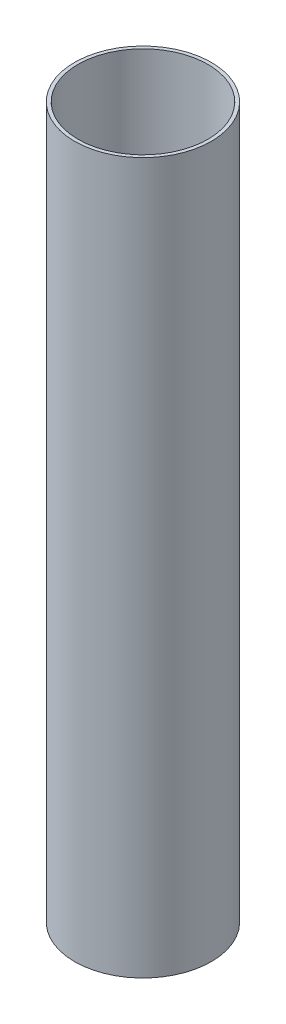
ISO-10303-21;
HEADER;
FILE_DESCRIPTION(('STEP AP214'),'2;1');
FILE_NAME('part.step','',(''),(''),'','','');
FILE_SCHEMA(('AUTOMOTIVE_DESIGN { 1 0 10303 214 1 1 1 1 }'));
ENDSEC;
DATA;
#1=APPLICATION_CONTEXT('core data for automotive mechanical design processes');
#2=APPLICATION_PROTOCOL_DEFINITION('international standard','automotive_design',2000,#1);
#3=PRODUCT_CONTEXT('',#1,'mechanical');
#4=PRODUCT('Part','Part','',(#3));
#5=PRODUCT_RELATED_PRODUCT_CATEGORY('part','',(#4));
#6=PRODUCT_DEFINITION_FORMATION('','',#4);
#7=PRODUCT_DEFINITION_CONTEXT('part definition',#1,'design');
#8=PRODUCT_DEFINITION('design','',#6,#7);
#9=PRODUCT_DEFINITION_SHAPE('','',#8);
#10=(LENGTH_UNIT() NAMED_UNIT(*) SI_UNIT(.MILLI.,.METRE.));
#11=(NAMED_UNIT(*) PLANE_ANGLE_UNIT() SI_UNIT($,.RADIAN.));
#12=(NAMED_UNIT(*) SI_UNIT($,.STERADIAN.) SOLID_ANGLE_UNIT());
#13=UNCERTAINTY_MEASURE_WITH_UNIT(LENGTH_MEASURE(1.E-05),#10,'distance_accuracy_value','');
#14=(GEOMETRIC_REPRESENTATION_CONTEXT(3) GLOBAL_UNCERTAINTY_ASSIGNED_CONTEXT((#13)) GLOBAL_UNIT_ASSIGNED_CONTEXT((#10,
#11,#12)) REPRESENTATION_CONTEXT('',''));
#15=CARTESIAN_POINT('',(0.,0.,0.));
#16=DIRECTION('',(0.,0.,1.));
#17=DIRECTION('',(1.,0.,0.));
#18=AXIS2_PLACEMENT_3D('',#15,#16,#17);
#19=CARTESIAN_POINT('',(0.,362.585,0.));
#20=DIRECTION('',(0.,1.,0.));
#21=DIRECTION('',(0.,0.,1.));
#22=AXIS2_PLACEMENT_3D('',#19,#20,#21);
#23=PLANE('',#22);
#24=CARTESIAN_POINT('',(0.,362.585,0.));
#25=DIRECTION('',(0.,1.,0.));
#26=DIRECTION('',(0.,0.,1.));
#27=AXIS2_PLACEMENT_3D('',#24,#25,#26);
#28=CIRCLE('',#27,34.8996);
#29=CARTESIAN_POINT('',(0.,362.585,34.8996));
#30=VERTEX_POINT('',#29);
#31=EDGE_CURVE('E10',#30,#30,#28,.T.);
#32=ORIENTED_EDGE('',*,*,#31,.T.);
#33=EDGE_LOOP('',(#32));
#34=FACE_BOUND('',#33,.T.);
#35=CARTESIAN_POINT('',(0.,362.585,0.));
#36=DIRECTION('',(0.,1.,0.));
#37=DIRECTION('',(0.,0.,1.));
#38=AXIS2_PLACEMENT_3D('',#35,#36,#37);
#39=CIRCLE('',#38,33.147);
#40=CARTESIAN_POINT('',(0.,362.585,33.147));
#41=VERTEX_POINT('',#40);
#42=EDGE_CURVE('E47',#41,#41,#39,.T.);
#43=ORIENTED_EDGE('',*,*,#42,.F.);
#44=EDGE_LOOP('',(#43));
#45=FACE_BOUND('',#44,.T.);
#46=ADVANCED_FACE('F36',(#34,#45),#23,.T.);
#47=CARTESIAN_POINT('',(0.,0.,0.));
#48=DIRECTION('',(0.,1.,0.));
#49=DIRECTION('',(0.,0.,1.));
#50=AXIS2_PLACEMENT_3D('',#47,#48,#49);
#51=PLANE('',#50);
#52=CARTESIAN_POINT('',(0.,0.,0.));
#53=DIRECTION('',(0.,1.,0.));
#54=DIRECTION('',(0.,0.,1.));
#55=AXIS2_PLACEMENT_3D('',#52,#53,#54);
#56=CIRCLE('',#55,34.8996);
#57=CARTESIAN_POINT('',(0.,0.,34.8996));
#58=VERTEX_POINT('',#57);
#59=EDGE_CURVE('E40',#58,#58,#56,.T.);
#60=ORIENTED_EDGE('',*,*,#59,.F.);
#61=EDGE_LOOP('',(#60));
#62=FACE_BOUND('',#61,.T.);
#63=CARTESIAN_POINT('',(0.,0.,0.));
#64=DIRECTION('',(0.,1.,0.));
#65=DIRECTION('',(0.,0.,1.));
#66=AXIS2_PLACEMENT_3D('',#63,#64,#65);
#67=CIRCLE('',#66,33.147);
#68=CARTESIAN_POINT('',(0.,0.,33.147));
#69=VERTEX_POINT('',#68);
#70=EDGE_CURVE('E49',#69,#69,#67,.T.);
#71=ORIENTED_EDGE('',*,*,#70,.T.);
#72=EDGE_LOOP('',(#71));
#73=FACE_BOUND('',#72,.T.);
#74=ADVANCED_FACE('F59',(#62,#73),#51,.F.);
#75=CARTESIAN_POINT('',(0.,362.585,0.));
#76=DIRECTION('',(0.,-1.,0.));
#77=DIRECTION('',(0.,0.,-1.));
#78=AXIS2_PLACEMENT_3D('',#75,#76,#77);
#79=CYLINDRICAL_SURFACE('',#78,34.8996);
#80=ORIENTED_EDGE('',*,*,#31,.F.);
#81=EDGE_LOOP('',(#80));
#82=FACE_BOUND('',#81,.T.);
#83=ORIENTED_EDGE('',*,*,#59,.T.);
#84=EDGE_LOOP('',(#83));
#85=FACE_BOUND('',#84,.T.);
#86=ADVANCED_FACE('F38',(#82,#85),#79,.T.);
#87=CARTESIAN_POINT('',(0.,362.585,0.));
#88=DIRECTION('',(0.,-1.,0.));
#89=DIRECTION('',(0.,0.,-1.));
#90=AXIS2_PLACEMENT_3D('',#87,#88,#89);
#91=CYLINDRICAL_SURFACE('',#90,33.147);
#92=ORIENTED_EDGE('',*,*,#42,.T.);
#93=EDGE_LOOP('',(#92));
#94=FACE_BOUND('',#93,.T.);
#95=ORIENTED_EDGE('',*,*,#70,.F.);
#96=EDGE_LOOP('',(#95));
#97=FACE_BOUND('',#96,.T.);
#98=ADVANCED_FACE('F55',(#94,#97),#91,.F.);
#99=CLOSED_SHELL('',(#46,#74,#86,#98));
#100=MANIFOLD_SOLID_BREP('B2',#99);
#101=ADVANCED_BREP_SHAPE_REPRESENTATION('',(#18,#100),#14);
#102=SHAPE_DEFINITION_REPRESENTATION(#9,#101);
ENDSEC;
END-ISO-10303-21;
